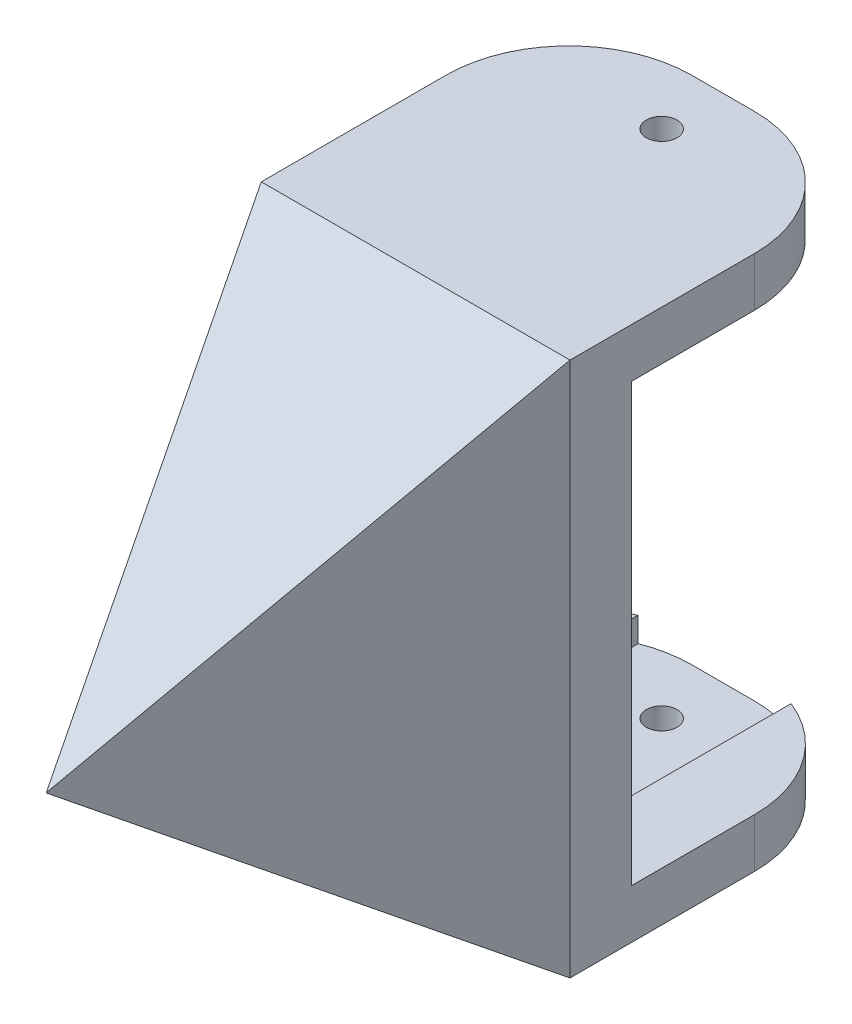
ISO-10303-21;
HEADER;
FILE_DESCRIPTION(('STEP AP214'),'2;1');
FILE_NAME('part.step','',(''),(''),'','','');
FILE_SCHEMA(('AUTOMOTIVE_DESIGN { 1 0 10303 214 1 1 1 1 }'));
ENDSEC;
DATA;
#1=APPLICATION_CONTEXT('core data for automotive mechanical design processes');
#2=APPLICATION_PROTOCOL_DEFINITION('international standard','automotive_design',2000,#1);
#3=PRODUCT_CONTEXT('',#1,'mechanical');
#4=PRODUCT('Part','Part','',(#3));
#5=PRODUCT_RELATED_PRODUCT_CATEGORY('part','',(#4));
#6=PRODUCT_DEFINITION_FORMATION('','',#4);
#7=PRODUCT_DEFINITION_CONTEXT('part definition',#1,'design');
#8=PRODUCT_DEFINITION('design','',#6,#7);
#9=PRODUCT_DEFINITION_SHAPE('','',#8);
#10=(LENGTH_UNIT() NAMED_UNIT(*) SI_UNIT(.MILLI.,.METRE.));
#11=(NAMED_UNIT(*) PLANE_ANGLE_UNIT() SI_UNIT($,.RADIAN.));
#12=(NAMED_UNIT(*) SI_UNIT($,.STERADIAN.) SOLID_ANGLE_UNIT());
#13=UNCERTAINTY_MEASURE_WITH_UNIT(LENGTH_MEASURE(1.E-05),#10,'distance_accuracy_value','');
#14=(GEOMETRIC_REPRESENTATION_CONTEXT(3) GLOBAL_UNCERTAINTY_ASSIGNED_CONTEXT((#13)) GLOBAL_UNIT_ASSIGNED_CONTEXT((#10,
#11,#12)) REPRESENTATION_CONTEXT('',''));
#15=CARTESIAN_POINT('',(0.,0.,0.));
#16=DIRECTION('',(0.,0.,1.));
#17=DIRECTION('',(1.,0.,0.));
#18=AXIS2_PLACEMENT_3D('',#15,#16,#17);
#19=CARTESIAN_POINT('',(62.7189846417763,-21.75,-25.));
#20=DIRECTION('',(0.,1.,0.));
#21=DIRECTION('',(0.,0.,1.));
#22=AXIS2_PLACEMENT_3D('',#19,#20,#21);
#23=PLANE('',#22);
#24=CARTESIAN_POINT('',(0.,-21.75,-20.));
#25=DIRECTION('',(0.,1.,0.));
#26=DIRECTION('',(0.,0.,1.));
#27=AXIS2_PLACEMENT_3D('',#24,#25,#26);
#28=CIRCLE('',#27,1.25);
#29=CARTESIAN_POINT('',(0.,-21.75,-18.75));
#30=VERTEX_POINT('',#29);
#31=EDGE_CURVE('E266',#30,#30,#28,.T.);
#32=ORIENTED_EDGE('',*,*,#31,.T.);
#33=EDGE_LOOP('',(#32));
#34=FACE_BOUND('',#33,.T.);
#35=DIRECTION('',(1.,0.,0.));
#36=VECTOR('',#35,1.);
#37=CARTESIAN_POINT('',(-12.5467811820916,-21.75,0.));
#38=LINE('',#37,#36);
#39=CARTESIAN_POINT('',(-12.5467811820916,-21.75,0.));
#40=VERTEX_POINT('',#39);
#41=CARTESIAN_POINT('',(12.5467811820916,-21.75,0.));
#42=VERTEX_POINT('',#41);
#43=EDGE_CURVE('E195',#40,#42,#38,.T.);
#44=ORIENTED_EDGE('',*,*,#43,.F.);
#45=DIRECTION('',(0.,0.,-1.));
#46=VECTOR('',#45,1.);
#47=CARTESIAN_POINT('',(-12.5467811820916,-21.75,-25.));
#48=LINE('',#47,#46);
#49=CARTESIAN_POINT('',(-12.5467811820916,-21.75,-15.));
#50=VERTEX_POINT('',#49);
#51=EDGE_CURVE('E178',#40,#50,#48,.T.);
#52=ORIENTED_EDGE('',*,*,#51,.T.);
#53=CARTESIAN_POINT('',(-2.54678118209162,-21.75,-15.));
#54=DIRECTION('',(0.,1.,0.));
#55=DIRECTION('',(0.,0.,1.));
#56=AXIS2_PLACEMENT_3D('',#53,#54,#55);
#57=CIRCLE('',#56,10.);
#58=CARTESIAN_POINT('',(-2.54678118209162,-21.75,-25.));
#59=VERTEX_POINT('',#58);
#60=EDGE_CURVE('E189',#50,#59,#57,.F.);
#61=ORIENTED_EDGE('',*,*,#60,.T.);
#62=DIRECTION('',(-1.,0.,0.));
#63=VECTOR('',#62,1.);
#64=CARTESIAN_POINT('',(62.7189846417763,-21.75,-25.));
#65=LINE('',#64,#63);
#66=CARTESIAN_POINT('',(2.54678118209161,-21.75,-25.));
#67=VERTEX_POINT('',#66);
#68=EDGE_CURVE('E295',#67,#59,#65,.T.);
#69=ORIENTED_EDGE('',*,*,#68,.F.);
#70=CARTESIAN_POINT('',(2.54678118209161,-21.75,-15.));
#71=DIRECTION('',(0.,1.,0.));
#72=DIRECTION('',(0.,0.,1.));
#73=AXIS2_PLACEMENT_3D('',#70,#71,#72);
#74=CIRCLE('',#73,10.);
#75=CARTESIAN_POINT('',(12.5467811820916,-21.75,-15.));
#76=VERTEX_POINT('',#75);
#77=EDGE_CURVE('E199',#67,#76,#74,.F.);
#78=ORIENTED_EDGE('',*,*,#77,.T.);
#79=DIRECTION('',(0.,0.,-1.));
#80=VECTOR('',#79,1.);
#81=CARTESIAN_POINT('',(12.5467811820916,-21.75,-25.));
#82=LINE('',#81,#80);
#83=EDGE_CURVE('E193',#42,#76,#82,.T.);
#84=ORIENTED_EDGE('',*,*,#83,.F.);
#85=EDGE_LOOP('',(#44,#52,#61,#69,#78,#84));
#86=FACE_BOUND('',#85,.T.);
#87=ADVANCED_FACE('F41',(#34,#86),#23,.F.);
#88=CARTESIAN_POINT('',(-12.5467811820916,-53.9370800671778,23.55));
#89=DIRECTION('',(-1.,0.,0.));
#90=DIRECTION('',(0.,0.,1.));
#91=AXIS2_PLACEMENT_3D('',#88,#89,#90);
#92=PLANE('',#91);
#93=DIRECTION('',(0.,0.,-1.));
#94=VECTOR('',#93,1.);
#95=CARTESIAN_POINT('',(-12.5467811820916,17.75,30.));
#96=LINE('',#95,#94);
#97=CARTESIAN_POINT('',(-12.5467811820916,17.75,0.));
#98=VERTEX_POINT('',#97);
#99=CARTESIAN_POINT('',(-12.5467811820916,17.75,-5.));
#100=VERTEX_POINT('',#99);
#101=EDGE_CURVE('E245',#98,#100,#96,.T.);
#102=ORIENTED_EDGE('',*,*,#101,.F.);
#103=DIRECTION('',(0.,-1.,0.));
#104=VECTOR('',#103,1.);
#105=CARTESIAN_POINT('',(-12.5467811820916,-21.75,0.));
#106=LINE('',#105,#104);
#107=CARTESIAN_POINT('',(-12.5467811820916,21.75,0.));
#108=VERTEX_POINT('',#107);
#109=EDGE_CURVE('E192',#108,#98,#106,.T.);
#110=ORIENTED_EDGE('',*,*,#109,.F.);
#111=DIRECTION('',(0.,0.,1.));
#112=VECTOR('',#111,1.);
#113=CARTESIAN_POINT('',(-12.5467811820916,21.75,0.));
#114=LINE('',#113,#112);
#115=CARTESIAN_POINT('',(-12.5467811820916,21.75,-15.));
#116=VERTEX_POINT('',#115);
#117=EDGE_CURVE('E300',#116,#108,#114,.T.);
#118=ORIENTED_EDGE('',*,*,#117,.F.);
#119=DIRECTION('',(0.,1.,0.));
#120=VECTOR('',#119,1.);
#121=CARTESIAN_POINT('',(-12.5467811820916,17.75,-15.));
#122=LINE('',#121,#120);
#123=CARTESIAN_POINT('',(-12.5467811820916,17.75,-15.));
#124=VERTEX_POINT('',#123);
#125=EDGE_CURVE('E212',#116,#124,#122,.F.);
#126=ORIENTED_EDGE('',*,*,#125,.T.);
#127=DIRECTION('',(0.,0.,-1.));
#128=VECTOR('',#127,1.);
#129=CARTESIAN_POINT('',(-12.5467811820916,17.75,-25.));
#130=LINE('',#129,#128);
#131=EDGE_CURVE('E303',#100,#124,#130,.T.);
#132=ORIENTED_EDGE('',*,*,#131,.F.);
#133=EDGE_LOOP('',(#102,#110,#118,#126,#132));
#134=FACE_BOUND('',#133,.T.);
#135=ADVANCED_FACE('F381',(#134),#92,.T.);
#136=CARTESIAN_POINT('',(62.7189846417763,-17.75,-5.));
#137=DIRECTION('',(0.,-1.,0.));
#138=DIRECTION('',(0.,0.,-1.));
#139=AXIS2_PLACEMENT_3D('',#136,#137,#138);
#140=PLANE('',#139);
#141=CARTESIAN_POINT('',(-2.54678118209162,-17.75,-15.));
#142=DIRECTION('',(0.,-1.,0.));
#143=DIRECTION('',(0.,0.,-1.));
#144=AXIS2_PLACEMENT_3D('',#141,#142,#143);
#145=CIRCLE('',#144,10.);
#146=CARTESIAN_POINT('',(-6.21914646917427,-17.75,-24.3012758908781));
#147=VERTEX_POINT('',#146);
#148=CARTESIAN_POINT('',(-10.239327171592,-17.75,-21.3894237767909));
#149=VERTEX_POINT('',#148);
#150=EDGE_CURVE('E206',#147,#149,#145,.F.);
#151=ORIENTED_EDGE('',*,*,#150,.T.);
#152=DIRECTION('',(0.,0.,1.));
#153=VECTOR('',#152,1.);
#154=CARTESIAN_POINT('',(-10.239327171592,-17.75,-5.00000000000001));
#155=LINE('',#154,#153);
#156=CARTESIAN_POINT('',(-10.239327171592,-17.75,-4.99999999999999));
#157=VERTEX_POINT('',#156);
#158=EDGE_CURVE('E180',#149,#157,#155,.T.);
#159=ORIENTED_EDGE('',*,*,#158,.T.);
#160=DIRECTION('',(-1.,0.,0.));
#161=VECTOR('',#160,1.);
#162=CARTESIAN_POINT('',(62.7189846417763,-17.75,-5.));
#163=LINE('',#162,#161);
#164=CARTESIAN_POINT('',(-6.21914646917426,-17.75,-4.99999999999999));
#165=VERTEX_POINT('',#164);
#166=EDGE_CURVE('E324',#165,#157,#163,.T.);
#167=ORIENTED_EDGE('',*,*,#166,.F.);
#168=DIRECTION('',(0.,0.,1.));
#169=VECTOR('',#168,1.);
#170=CARTESIAN_POINT('',(-6.21914646917427,-17.75,-25.));
#171=LINE('',#170,#169);
#172=EDGE_CURVE('E273',#147,#165,#171,.T.);
#173=ORIENTED_EDGE('',*,*,#172,.F.);
#174=EDGE_LOOP('',(#151,#159,#167,#173));
#175=FACE_BOUND('',#174,.T.);
#176=ADVANCED_FACE('F382',(#175),#140,.F.);
#177=DIRECTION('',(0.,0.,1.));
#178=VECTOR('',#177,1.);
#179=CARTESIAN_POINT('',(12.5467811820916,-17.75,-5.));
#180=LINE('',#179,#178);
#181=CARTESIAN_POINT('',(12.5467811820916,-17.75,-15.));
#182=VERTEX_POINT('',#181);
#183=CARTESIAN_POINT('',(12.5467811820916,-17.75,-5.));
#184=VERTEX_POINT('',#183);
#185=EDGE_CURVE('E319',#182,#184,#180,.T.);
#186=ORIENTED_EDGE('',*,*,#185,.F.);
#187=CARTESIAN_POINT('',(2.54678118209161,-17.75,-15.));
#188=DIRECTION('',(0.,-1.,0.));
#189=DIRECTION('',(0.,0.,-1.));
#190=AXIS2_PLACEMENT_3D('',#187,#188,#189);
#191=CIRCLE('',#190,10.);
#192=CARTESIAN_POINT('',(6.21914646917426,-17.75,-24.3012758908781));
#193=VERTEX_POINT('',#192);
#194=EDGE_CURVE('E339',#182,#193,#191,.F.);
#195=ORIENTED_EDGE('',*,*,#194,.T.);
#196=DIRECTION('',(0.,0.,-1.));
#197=VECTOR('',#196,1.);
#198=CARTESIAN_POINT('',(6.21914646917425,-17.75,-25.));
#199=LINE('',#198,#197);
#200=CARTESIAN_POINT('',(6.21914646917428,-17.75,-5.));
#201=VERTEX_POINT('',#200);
#202=EDGE_CURVE('E277',#201,#193,#199,.T.);
#203=ORIENTED_EDGE('',*,*,#202,.F.);
#204=EDGE_CURVE('E325',#184,#201,#163,.T.);
#205=ORIENTED_EDGE('',*,*,#204,.F.);
#206=EDGE_LOOP('',(#186,#195,#203,#205));
#207=FACE_BOUND('',#206,.T.);
#208=ADVANCED_FACE('F363',(#207),#140,.F.);
#209=CARTESIAN_POINT('',(12.5467811820916,-53.9370800671778,23.55));
#210=DIRECTION('',(1.,0.,0.));
#211=DIRECTION('',(0.,0.,-1.));
#212=AXIS2_PLACEMENT_3D('',#209,#210,#211);
#213=PLANE('',#212);
#214=DIRECTION('',(0.,-1.,0.));
#215=VECTOR('',#214,1.);
#216=CARTESIAN_POINT('',(12.5467811820916,-21.75,0.));
#217=LINE('',#216,#215);
#218=CARTESIAN_POINT('',(12.5467811820916,21.75,0.));
#219=VERTEX_POINT('',#218);
#220=EDGE_CURVE('E307',#219,#42,#217,.T.);
#221=ORIENTED_EDGE('',*,*,#220,.T.);
#222=ORIENTED_EDGE('',*,*,#83,.T.);
#223=DIRECTION('',(0.,1.,0.));
#224=VECTOR('',#223,1.);
#225=CARTESIAN_POINT('',(12.5467811820916,-17.75,-15.));
#226=LINE('',#225,#224);
#227=EDGE_CURVE('E338',#76,#182,#226,.T.);
#228=ORIENTED_EDGE('',*,*,#227,.T.);
#229=ORIENTED_EDGE('',*,*,#185,.T.);
#230=DIRECTION('',(0.,1.,0.));
#231=VECTOR('',#230,1.);
#232=CARTESIAN_POINT('',(12.5467811820916,17.75,-5.));
#233=LINE('',#232,#231);
#234=CARTESIAN_POINT('',(12.5467811820916,17.75,-5.));
#235=VERTEX_POINT('',#234);
#236=EDGE_CURVE('E313',#184,#235,#233,.T.);
#237=ORIENTED_EDGE('',*,*,#236,.T.);
#238=DIRECTION('',(0.,0.,-1.));
#239=VECTOR('',#238,1.);
#240=CARTESIAN_POINT('',(12.5467811820916,17.75,-25.));
#241=LINE('',#240,#239);
#242=CARTESIAN_POINT('',(12.5467811820916,17.75,-15.));
#243=VERTEX_POINT('',#242);
#244=EDGE_CURVE('E315',#235,#243,#241,.T.);
#245=ORIENTED_EDGE('',*,*,#244,.T.);
#246=DIRECTION('',(0.,1.,0.));
#247=VECTOR('',#246,1.);
#248=CARTESIAN_POINT('',(12.5467811820916,21.75,-15.));
#249=LINE('',#248,#247);
#250=CARTESIAN_POINT('',(12.5467811820916,21.75,-15.));
#251=VERTEX_POINT('',#250);
#252=EDGE_CURVE('E306',#243,#251,#249,.T.);
#253=ORIENTED_EDGE('',*,*,#252,.T.);
#254=DIRECTION('',(0.,0.,1.));
#255=VECTOR('',#254,1.);
#256=CARTESIAN_POINT('',(12.5467811820916,21.75,0.));
#257=LINE('',#256,#255);
#258=EDGE_CURVE('E309',#251,#219,#257,.T.);
#259=ORIENTED_EDGE('',*,*,#258,.T.);
#260=EDGE_LOOP('',(#221,#222,#228,#229,#237,#245,#253,#259));
#261=FACE_BOUND('',#260,.T.);
#262=ADVANCED_FACE('F362',(#261),#213,.T.);
#263=CARTESIAN_POINT('',(62.7189846417763,-17.75,-25.));
#264=DIRECTION('',(0.,0.,1.));
#265=DIRECTION('',(0.,-1.,0.));
#266=AXIS2_PLACEMENT_3D('',#263,#264,#265);
#267=PLANE('',#266);
#268=DIRECTION('',(-1.,0.,0.));
#269=VECTOR('',#268,1.);
#270=CARTESIAN_POINT('',(6.21914646917425,-19.75,-25.));
#271=LINE('',#270,#269);
#272=CARTESIAN_POINT('',(2.54678118209161,-19.75,-25.));
#273=VERTEX_POINT('',#272);
#274=CARTESIAN_POINT('',(-2.54678118209162,-19.75,-25.));
#275=VERTEX_POINT('',#274);
#276=EDGE_CURVE('E272',#273,#275,#271,.T.);
#277=ORIENTED_EDGE('',*,*,#276,.F.);
#278=DIRECTION('',(0.,1.,0.));
#279=VECTOR('',#278,1.);
#280=CARTESIAN_POINT('',(2.54678118209161,-21.75,-25.));
#281=LINE('',#280,#279);
#282=EDGE_CURVE('E201',#273,#67,#281,.F.);
#283=ORIENTED_EDGE('',*,*,#282,.T.);
#284=ORIENTED_EDGE('',*,*,#68,.T.);
#285=DIRECTION('',(0.,1.,0.));
#286=VECTOR('',#285,1.);
#287=CARTESIAN_POINT('',(-2.54678118209162,-17.75,-25.));
#288=LINE('',#287,#286);
#289=EDGE_CURVE('E197',#59,#275,#288,.T.);
#290=ORIENTED_EDGE('',*,*,#289,.T.);
#291=EDGE_LOOP('',(#277,#283,#284,#290));
#292=FACE_BOUND('',#291,.T.);
#293=ADVANCED_FACE('F348',(#292),#267,.F.);
#294=CARTESIAN_POINT('',(62.7189846417763,17.75,-5.));
#295=DIRECTION('',(0.,0.,1.));
#296=DIRECTION('',(0.,-1.,0.));
#297=AXIS2_PLACEMENT_3D('',#294,#295,#296);
#298=PLANE('',#297);
#299=ORIENTED_EDGE('',*,*,#166,.T.);
#300=DIRECTION('',(0.499683735875138,0.866207921980551,0.));
#301=VECTOR('',#300,1.);
#302=CARTESIAN_POINT('',(23.3426493553679,40.4647706938501,-5.00000000000001));
#303=LINE('',#302,#301);
#304=CARTESIAN_POINT('',(0.,0.,-5.));
#305=VERTEX_POINT('',#304);
#306=EDGE_CURVE('E250',#157,#305,#303,.T.);
#307=ORIENTED_EDGE('',*,*,#306,.T.);
#308=DIRECTION('',(-0.577216411505274,0.816591216147329,0.));
#309=VECTOR('',#308,1.);
#310=CARTESIAN_POINT('',(12.5301752807151,-17.7265075404477,-5.));
#311=LINE('',#310,#309);
#312=EDGE_CURVE('E252',#305,#100,#311,.T.);
#313=ORIENTED_EDGE('',*,*,#312,.T.);
#314=DIRECTION('',(-1.,0.,0.));
#315=VECTOR('',#314,1.);
#316=CARTESIAN_POINT('',(62.7189846417763,17.75,-5.));
#317=LINE('',#316,#315);
#318=EDGE_CURVE('E301',#235,#100,#317,.T.);
#319=ORIENTED_EDGE('',*,*,#318,.F.);
#320=ORIENTED_EDGE('',*,*,#236,.F.);
#321=ORIENTED_EDGE('',*,*,#204,.T.);
#322=DIRECTION('',(0.,1.,0.));
#323=VECTOR('',#322,1.);
#324=CARTESIAN_POINT('',(6.21914646917428,-19.75,-5.));
#325=LINE('',#324,#323);
#326=CARTESIAN_POINT('',(6.21914646917428,-19.75,-5.));
#327=VERTEX_POINT('',#326);
#328=EDGE_CURVE('E288',#327,#201,#325,.T.);
#329=ORIENTED_EDGE('',*,*,#328,.F.);
#330=DIRECTION('',(1.,0.,0.));
#331=VECTOR('',#330,1.);
#332=CARTESIAN_POINT('',(6.21914646917428,-19.75,-5.));
#333=LINE('',#332,#331);
#334=CARTESIAN_POINT('',(-6.21914646917426,-19.75,-4.99999999999999));
#335=VERTEX_POINT('',#334);
#336=EDGE_CURVE('E279',#335,#327,#333,.T.);
#337=ORIENTED_EDGE('',*,*,#336,.F.);
#338=DIRECTION('',(0.,1.,0.));
#339=VECTOR('',#338,1.);
#340=CARTESIAN_POINT('',(-6.21914646917426,-19.75,-4.99999999999999));
#341=LINE('',#340,#339);
#342=EDGE_CURVE('E287',#335,#165,#341,.T.);
#343=ORIENTED_EDGE('',*,*,#342,.T.);
#344=EDGE_LOOP('',(#299,#307,#313,#319,#320,#321,#329,#337,#343));
#345=FACE_BOUND('',#344,.T.);
#346=ADVANCED_FACE('F375',(#345),#298,.F.);
#347=CARTESIAN_POINT('',(62.7189846417763,17.75,-25.));
#348=DIRECTION('',(0.,1.,0.));
#349=DIRECTION('',(0.,0.,1.));
#350=AXIS2_PLACEMENT_3D('',#347,#348,#349);
#351=PLANE('',#350);
#352=CARTESIAN_POINT('',(0.,17.75,-20.));
#353=DIRECTION('',(0.,1.,0.));
#354=DIRECTION('',(0.,0.,1.));
#355=AXIS2_PLACEMENT_3D('',#352,#353,#354);
#356=CIRCLE('',#355,1.25);
#357=CARTESIAN_POINT('',(0.,17.75,-18.75));
#358=VERTEX_POINT('',#357);
#359=EDGE_CURVE('E269',#358,#358,#356,.T.);
#360=ORIENTED_EDGE('',*,*,#359,.T.);
#361=EDGE_LOOP('',(#360));
#362=FACE_BOUND('',#361,.T.);
#363=ORIENTED_EDGE('',*,*,#131,.T.);
#364=CARTESIAN_POINT('',(-2.54678118209162,17.75,-15.));
#365=DIRECTION('',(0.,1.,0.));
#366=DIRECTION('',(0.,0.,1.));
#367=AXIS2_PLACEMENT_3D('',#364,#365,#366);
#368=CIRCLE('',#367,10.);
#369=CARTESIAN_POINT('',(-2.54678118209162,17.75,-25.));
#370=VERTEX_POINT('',#369);
#371=EDGE_CURVE('E223',#124,#370,#368,.F.);
#372=ORIENTED_EDGE('',*,*,#371,.T.);
#373=DIRECTION('',(-1.,0.,0.));
#374=VECTOR('',#373,1.);
#375=CARTESIAN_POINT('',(62.7189846417763,17.75,-25.));
#376=LINE('',#375,#374);
#377=CARTESIAN_POINT('',(2.54678118209161,17.75,-25.));
#378=VERTEX_POINT('',#377);
#379=EDGE_CURVE('E305',#378,#370,#376,.T.);
#380=ORIENTED_EDGE('',*,*,#379,.F.);
#381=CARTESIAN_POINT('',(2.54678118209161,17.75,-15.));
#382=DIRECTION('',(0.,1.,0.));
#383=DIRECTION('',(0.,0.,1.));
#384=AXIS2_PLACEMENT_3D('',#381,#382,#383);
#385=CIRCLE('',#384,10.);
#386=EDGE_CURVE('E216',#378,#243,#385,.F.);
#387=ORIENTED_EDGE('',*,*,#386,.T.);
#388=ORIENTED_EDGE('',*,*,#244,.F.);
#389=ORIENTED_EDGE('',*,*,#318,.T.);
#390=EDGE_LOOP('',(#363,#372,#380,#387,#388,#389));
#391=FACE_BOUND('',#390,.T.);
#392=ADVANCED_FACE('F410',(#362,#391),#351,.F.);
#393=CARTESIAN_POINT('',(62.7189846417763,21.75,-25.));
#394=DIRECTION('',(0.,0.,1.));
#395=DIRECTION('',(0.,-1.,0.));
#396=AXIS2_PLACEMENT_3D('',#393,#394,#395);
#397=PLANE('',#396);
#398=ORIENTED_EDGE('',*,*,#379,.T.);
#399=DIRECTION('',(0.,1.,0.));
#400=VECTOR('',#399,1.);
#401=CARTESIAN_POINT('',(-2.54678118209162,21.75,-25.));
#402=LINE('',#401,#400);
#403=CARTESIAN_POINT('',(-2.54678118209162,21.75,-25.));
#404=VERTEX_POINT('',#403);
#405=EDGE_CURVE('E213',#370,#404,#402,.T.);
#406=ORIENTED_EDGE('',*,*,#405,.T.);
#407=DIRECTION('',(-1.,0.,0.));
#408=VECTOR('',#407,1.);
#409=CARTESIAN_POINT('',(62.7189846417763,21.75,-25.));
#410=LINE('',#409,#408);
#411=CARTESIAN_POINT('',(2.54678118209161,21.75,-25.));
#412=VERTEX_POINT('',#411);
#413=EDGE_CURVE('E299',#412,#404,#410,.T.);
#414=ORIENTED_EDGE('',*,*,#413,.F.);
#415=DIRECTION('',(0.,1.,0.));
#416=VECTOR('',#415,1.);
#417=CARTESIAN_POINT('',(2.54678118209161,17.75,-25.));
#418=LINE('',#417,#416);
#419=EDGE_CURVE('E214',#412,#378,#418,.F.);
#420=ORIENTED_EDGE('',*,*,#419,.T.);
#421=EDGE_LOOP('',(#398,#406,#414,#420));
#422=FACE_BOUND('',#421,.T.);
#423=ADVANCED_FACE('F401',(#422),#397,.F.);
#424=CARTESIAN_POINT('',(62.7189846417763,21.75,0.));
#425=DIRECTION('',(0.,-1.,0.));
#426=DIRECTION('',(0.,0.,-1.));
#427=AXIS2_PLACEMENT_3D('',#424,#425,#426);
#428=PLANE('',#427);
#429=CARTESIAN_POINT('',(0.,21.75,-20.));
#430=DIRECTION('',(0.,1.,0.));
#431=DIRECTION('',(0.,0.,1.));
#432=AXIS2_PLACEMENT_3D('',#429,#430,#431);
#433=CIRCLE('',#432,1.25);
#434=CARTESIAN_POINT('',(0.,21.75,-18.75));
#435=VERTEX_POINT('',#434);
#436=EDGE_CURVE('E261',#435,#435,#433,.T.);
#437=ORIENTED_EDGE('',*,*,#436,.F.);
#438=EDGE_LOOP('',(#437));
#439=FACE_BOUND('',#438,.T.);
#440=ORIENTED_EDGE('',*,*,#117,.T.);
#441=DIRECTION('',(1.,0.,0.));
#442=VECTOR('',#441,1.);
#443=CARTESIAN_POINT('',(-12.5467811820916,21.75,0.));
#444=LINE('',#443,#442);
#445=EDGE_CURVE('E257',#108,#219,#444,.T.);
#446=ORIENTED_EDGE('',*,*,#445,.T.);
#447=ORIENTED_EDGE('',*,*,#258,.F.);
#448=CARTESIAN_POINT('',(2.54678118209161,21.75,-15.));
#449=DIRECTION('',(0.,-1.,0.));
#450=DIRECTION('',(0.,0.,-1.));
#451=AXIS2_PLACEMENT_3D('',#448,#449,#450);
#452=CIRCLE('',#451,10.);
#453=EDGE_CURVE('E61',#251,#412,#452,.F.);
#454=ORIENTED_EDGE('',*,*,#453,.T.);
#455=ORIENTED_EDGE('',*,*,#413,.T.);
#456=CARTESIAN_POINT('',(-2.54678118209162,21.75,-15.));
#457=DIRECTION('',(0.,-1.,0.));
#458=DIRECTION('',(0.,0.,-1.));
#459=AXIS2_PLACEMENT_3D('',#456,#457,#458);
#460=CIRCLE('',#459,10.);
#461=EDGE_CURVE('E57',#404,#116,#460,.F.);
#462=ORIENTED_EDGE('',*,*,#461,.T.);
#463=EDGE_LOOP('',(#440,#446,#447,#454,#455,#462));
#464=FACE_BOUND('',#463,.T.);
#465=ADVANCED_FACE('F402',(#439,#464),#428,.F.);
#466=CARTESIAN_POINT('',(6.21914646917425,-19.75,-25.));
#467=DIRECTION('',(1.,0.,0.));
#468=DIRECTION('',(0.,0.,-1.));
#469=AXIS2_PLACEMENT_3D('',#466,#467,#468);
#470=PLANE('',#469);
#471=ORIENTED_EDGE('',*,*,#202,.T.);
#472=DIRECTION('',(0.,-1.,0.));
#473=VECTOR('',#472,1.);
#474=CARTESIAN_POINT('',(6.21914646917426,-17.75,-24.3012758908781));
#475=LINE('',#474,#473);
#476=CARTESIAN_POINT('',(6.21914646917426,-19.75,-24.3012758908781));
#477=VERTEX_POINT('',#476);
#478=EDGE_CURVE('E341',#193,#477,#475,.T.);
#479=ORIENTED_EDGE('',*,*,#478,.T.);
#480=DIRECTION('',(0.,0.,-1.));
#481=VECTOR('',#480,1.);
#482=CARTESIAN_POINT('',(6.21914646917425,-19.75,-25.));
#483=LINE('',#482,#481);
#484=EDGE_CURVE('E284',#327,#477,#483,.T.);
#485=ORIENTED_EDGE('',*,*,#484,.F.);
#486=ORIENTED_EDGE('',*,*,#328,.T.);
#487=EDGE_LOOP('',(#471,#479,#485,#486));
#488=FACE_BOUND('',#487,.T.);
#489=ADVANCED_FACE('F369',(#488),#470,.F.);
#490=CARTESIAN_POINT('',(-6.21914646917427,-19.75,-25.));
#491=DIRECTION('',(-1.,0.,0.));
#492=DIRECTION('',(0.,0.,1.));
#493=AXIS2_PLACEMENT_3D('',#490,#491,#492);
#494=PLANE('',#493);
#495=DIRECTION('',(0.,0.,1.));
#496=VECTOR('',#495,1.);
#497=CARTESIAN_POINT('',(-6.21914646917427,-19.75,-25.));
#498=LINE('',#497,#496);
#499=CARTESIAN_POINT('',(-6.21914646917427,-19.75,-24.3012758908781));
#500=VERTEX_POINT('',#499);
#501=EDGE_CURVE('E280',#500,#335,#498,.T.);
#502=ORIENTED_EDGE('',*,*,#501,.F.);
#503=DIRECTION('',(0.,-1.,0.));
#504=VECTOR('',#503,1.);
#505=CARTESIAN_POINT('',(-6.21914646917427,-19.75,-24.3012758908781));
#506=LINE('',#505,#504);
#507=EDGE_CURVE('E202',#500,#147,#506,.F.);
#508=ORIENTED_EDGE('',*,*,#507,.T.);
#509=ORIENTED_EDGE('',*,*,#172,.T.);
#510=ORIENTED_EDGE('',*,*,#342,.F.);
#511=EDGE_LOOP('',(#502,#508,#509,#510));
#512=FACE_BOUND('',#511,.T.);
#513=ADVANCED_FACE('F379',(#512),#494,.F.);
#514=CARTESIAN_POINT('',(0.,-19.75,0.));
#515=DIRECTION('',(0.,1.,0.));
#516=DIRECTION('',(0.,0.,1.));
#517=AXIS2_PLACEMENT_3D('',#514,#515,#516);
#518=PLANE('',#517);
#519=CARTESIAN_POINT('',(0.,-19.75,-20.));
#520=DIRECTION('',(0.,1.,0.));
#521=DIRECTION('',(0.,0.,1.));
#522=AXIS2_PLACEMENT_3D('',#519,#520,#521);
#523=CIRCLE('',#522,1.25);
#524=CARTESIAN_POINT('',(0.,-19.75,-18.75));
#525=VERTEX_POINT('',#524);
#526=EDGE_CURVE('E267',#525,#525,#523,.T.);
#527=ORIENTED_EDGE('',*,*,#526,.F.);
#528=EDGE_LOOP('',(#527));
#529=FACE_BOUND('',#528,.T.);
#530=ORIENTED_EDGE('',*,*,#484,.T.);
#531=CARTESIAN_POINT('',(2.54678118209161,-19.75,-15.));
#532=DIRECTION('',(0.,1.,0.));
#533=DIRECTION('',(0.,0.,1.));
#534=AXIS2_PLACEMENT_3D('',#531,#532,#533);
#535=CIRCLE('',#534,10.);
#536=EDGE_CURVE('E344',#477,#273,#535,.T.);
#537=ORIENTED_EDGE('',*,*,#536,.T.);
#538=ORIENTED_EDGE('',*,*,#276,.T.);
#539=CARTESIAN_POINT('',(-2.54678118209162,-19.75,-15.));
#540=DIRECTION('',(0.,1.,0.));
#541=DIRECTION('',(0.,0.,1.));
#542=AXIS2_PLACEMENT_3D('',#539,#540,#541);
#543=CIRCLE('',#542,10.);
#544=EDGE_CURVE('E343',#275,#500,#543,.T.);
#545=ORIENTED_EDGE('',*,*,#544,.T.);
#546=ORIENTED_EDGE('',*,*,#501,.T.);
#547=ORIENTED_EDGE('',*,*,#336,.T.);
#548=EDGE_LOOP('',(#530,#537,#538,#545,#546,#547));
#549=FACE_BOUND('',#548,.T.);
#550=ADVANCED_FACE('F351',(#529,#549),#518,.T.);
#551=CARTESIAN_POINT('',(0.,-21.75,-20.));
#552=DIRECTION('',(0.,1.,0.));
#553=DIRECTION('',(0.,0.,1.));
#554=AXIS2_PLACEMENT_3D('',#551,#552,#553);
#555=CYLINDRICAL_SURFACE('',#554,1.25);
#556=ORIENTED_EDGE('',*,*,#526,.T.);
#557=EDGE_LOOP('',(#556));
#558=FACE_BOUND('',#557,.T.);
#559=ORIENTED_EDGE('',*,*,#31,.F.);
#560=EDGE_LOOP('',(#559));
#561=FACE_BOUND('',#560,.T.);
#562=ADVANCED_FACE('F459',(#558,#561),#555,.F.);
#563=ORIENTED_EDGE('',*,*,#436,.T.);
#564=EDGE_LOOP('',(#563));
#565=FACE_BOUND('',#564,.T.);
#566=ORIENTED_EDGE('',*,*,#359,.F.);
#567=EDGE_LOOP('',(#566));
#568=FACE_BOUND('',#567,.T.);
#569=ADVANCED_FACE('F423',(#565,#568),#555,.F.);
#570=CARTESIAN_POINT('',(2.54678118209161,-53.9370800671777,-15.0000000000001));
#571=DIRECTION('',(0.,-1.,0.));
#572=DIRECTION('',(0.,0.,-1.));
#573=AXIS2_PLACEMENT_3D('',#570,#571,#572);
#574=CYLINDRICAL_SURFACE('',#573,10.);
#575=ORIENTED_EDGE('',*,*,#77,.F.);
#576=ORIENTED_EDGE('',*,*,#282,.F.);
#577=ORIENTED_EDGE('',*,*,#536,.F.);
#578=ORIENTED_EDGE('',*,*,#478,.F.);
#579=ORIENTED_EDGE('',*,*,#194,.F.);
#580=ORIENTED_EDGE('',*,*,#227,.F.);
#581=EDGE_LOOP('',(#575,#576,#577,#578,#579,#580));
#582=FACE_BOUND('',#581,.T.);
#583=ADVANCED_FACE('F359',(#582),#574,.T.);
#584=CARTESIAN_POINT('',(-2.54678118209162,-17.75,-15.));
#585=DIRECTION('',(0.,-1.,0.));
#586=DIRECTION('',(0.,0.,-1.));
#587=AXIS2_PLACEMENT_3D('',#584,#585,#586);
#588=CYLINDRICAL_SURFACE('',#587,10.);
#589=CARTESIAN_POINT('',(-2.54678118209162,-4.41487660512929,-14.9999999999999));
#590=DIRECTION('',(0.866207921980551,-0.499683735875138,0.));
#591=DIRECTION('',(-0.499683735875138,-0.866207921980551,0.));
#592=AXIS2_PLACEMENT_3D('',#589,#590,#591);
#593=ELLIPSE('',#592,20.0126585718988,10.);
#594=EDGE_CURVE('E171',#149,#50,#593,.F.);
#595=ORIENTED_EDGE('',*,*,#594,.F.);
#596=ORIENTED_EDGE('',*,*,#150,.F.);
#597=ORIENTED_EDGE('',*,*,#507,.F.);
#598=ORIENTED_EDGE('',*,*,#544,.F.);
#599=ORIENTED_EDGE('',*,*,#289,.F.);
#600=ORIENTED_EDGE('',*,*,#60,.F.);
#601=EDGE_LOOP('',(#595,#596,#597,#598,#599,#600));
#602=FACE_BOUND('',#601,.T.);
#603=ADVANCED_FACE('F200',(#602),#588,.T.);
#604=CARTESIAN_POINT('',(-2.54678118209162,21.75,-15.));
#605=DIRECTION('',(0.,-1.,0.));
#606=DIRECTION('',(0.,0.,-1.));
#607=AXIS2_PLACEMENT_3D('',#604,#605,#606);
#608=CYLINDRICAL_SURFACE('',#607,10.);
#609=ORIENTED_EDGE('',*,*,#371,.F.);
#610=ORIENTED_EDGE('',*,*,#125,.F.);
#611=ORIENTED_EDGE('',*,*,#461,.F.);
#612=ORIENTED_EDGE('',*,*,#405,.F.);
#613=EDGE_LOOP('',(#609,#610,#611,#612));
#614=FACE_BOUND('',#613,.T.);
#615=ADVANCED_FACE('F424',(#614),#608,.T.);
#616=CARTESIAN_POINT('',(2.54678118209161,-53.9370800671778,-15.));
#617=DIRECTION('',(0.,-1.,0.));
#618=DIRECTION('',(0.,0.,-1.));
#619=AXIS2_PLACEMENT_3D('',#616,#617,#618);
#620=CYLINDRICAL_SURFACE('',#619,10.);
#621=ORIENTED_EDGE('',*,*,#386,.F.);
#622=ORIENTED_EDGE('',*,*,#419,.F.);
#623=ORIENTED_EDGE('',*,*,#453,.F.);
#624=ORIENTED_EDGE('',*,*,#252,.F.);
#625=EDGE_LOOP('',(#621,#622,#623,#624));
#626=FACE_BOUND('',#625,.T.);
#627=ADVANCED_FACE('F43',(#626),#620,.T.);
#628=CARTESIAN_POINT('',(12.5467811820916,-21.75,0.));
#629=DIRECTION('',(0.922286989349462,0.,0.386505768749582));
#630=DIRECTION('',(0.386505768749582,0.,-0.922286989349462));
#631=AXIS2_PLACEMENT_3D('',#628,#629,#630);
#632=PLANE('',#631);
#633=DIRECTION('',(0.321095530084189,0.556623063555085,-0.766203906071031));
#634=VECTOR('',#633,1.);
#635=CARTESIAN_POINT('',(4.77206195434683,8.27242828265701,18.5521742994731));
#636=LINE('',#635,#634);
#637=CARTESIAN_POINT('',(-0.0155796718918816,-0.0270075534697359,29.9765305149912));
#638=VERTEX_POINT('',#637);
#639=CARTESIAN_POINT('',(0.,0.,29.9393540228247));
#640=VERTEX_POINT('',#639);
#641=EDGE_CURVE('E185',#638,#640,#636,.T.);
#642=ORIENTED_EDGE('',*,*,#641,.F.);
#643=DIRECTION('',(-0.321342267556626,0.555669092141227,0.766792675447875));
#644=VECTOR('',#643,1.);
#645=CARTESIAN_POINT('',(12.5467811820916,-21.75,0.));
#646=LINE('',#645,#644);
#647=EDGE_CURVE('E230',#42,#638,#646,.T.);
#648=ORIENTED_EDGE('',*,*,#647,.F.);
#649=ORIENTED_EDGE('',*,*,#220,.F.);
#650=DIRECTION('',(0.321342267556626,0.555669092141227,-0.766792675447875));
#651=VECTOR('',#650,1.);
#652=CARTESIAN_POINT('',(4.77942265762059,8.31858591169409,18.5346100574599));
#653=LINE('',#652,#651);
#654=CARTESIAN_POINT('',(-0.0171595178991377,0.0242756638766002,29.9803003718354));
#655=VERTEX_POINT('',#654);
#656=EDGE_CURVE('E259',#655,#219,#653,.T.);
#657=ORIENTED_EDGE('',*,*,#656,.F.);
#658=DIRECTION('',(-0.339120880045265,0.479756164823781,0.809216319058694));
#659=VECTOR('',#658,1.);
#660=CARTESIAN_POINT('',(13.1975625133803,-18.6706639107457,-1.55290607097766));
#661=LINE('',#660,#659);
#662=EDGE_CURVE('E236',#640,#655,#661,.T.);
#663=ORIENTED_EDGE('',*,*,#662,.F.);
#664=EDGE_LOOP('',(#642,#648,#649,#657,#663));
#665=FACE_BOUND('',#664,.T.);
#666=ADVANCED_FACE('F233',(#665),#632,.T.);
#667=CARTESIAN_POINT('',(-0.0254151043009368,-21.75,30.));
#668=DIRECTION('',(-0.922843409478252,0.,0.385175338751789));
#669=DIRECTION('',(0.385175338751789,0.,0.922843409478252));
#670=AXIS2_PLACEMENT_3D('',#667,#668,#669);
#671=PLANE('',#670);
#672=DIRECTION('',(-0.338221167898573,0.478483337126221,-0.810345690232187));
#673=VECTOR('',#672,1.);
#674=CARTESIAN_POINT('',(3.50027553987889,-4.95185896136693,38.4472188312585));
#675=LINE('',#674,#673);
#676=CARTESIAN_POINT('',(-0.106138970431229,0.150155382309755,29.8065933086802));
#677=VERTEX_POINT('',#676);
#678=EDGE_CURVE('E249',#677,#98,#675,.T.);
#679=ORIENTED_EDGE('',*,*,#678,.F.);
#680=DIRECTION('',(0.320176488013293,-0.555900754451638,0.767112356648994));
#681=VECTOR('',#680,1.);
#682=CARTESIAN_POINT('',(3.84756789877427,-6.71439811788583,39.2792982307532));
#683=LINE('',#682,#681);
#684=EDGE_CURVE('E221',#108,#677,#683,.T.);
#685=ORIENTED_EDGE('',*,*,#684,.F.);
#686=ORIENTED_EDGE('',*,*,#109,.T.);
#687=EDGE_LOOP('',(#679,#685,#686));
#688=FACE_BOUND('',#687,.T.);
#689=ADVANCED_FACE('F447',(#688),#671,.T.);
#690=CARTESIAN_POINT('',(-12.5467811820916,21.75,0.));
#691=DIRECTION('',(0.,-0.80973869074154,-0.586790637890703));
#692=DIRECTION('',(0.,0.586790637890702,-0.809738690741539));
#693=AXIS2_PLACEMENT_3D('',#690,#691,#692);
#694=PLANE('',#693);
#695=ORIENTED_EDGE('',*,*,#684,.T.);
#696=DIRECTION('',(0.383129479592113,-0.542015371437785,0.747951294532362));
#697=VECTOR('',#696,1.);
#698=CARTESIAN_POINT('',(-14.9591894705444,21.1628472074699,0.810238444153764));
#699=LINE('',#698,#697);
#700=EDGE_CURVE('E11',#677,#655,#699,.T.);
#701=ORIENTED_EDGE('',*,*,#700,.T.);
#702=ORIENTED_EDGE('',*,*,#656,.T.);
#703=ORIENTED_EDGE('',*,*,#445,.F.);
#704=EDGE_LOOP('',(#695,#701,#702,#703));
#705=FACE_BOUND('',#704,.T.);
#706=ADVANCED_FACE('F441',(#705),#694,.F.);
#707=CARTESIAN_POINT('',(-12.5467811820916,-0.01,30.));
#708=DIRECTION('',(0.,0.80973869074154,-0.586790637890703));
#709=DIRECTION('',(0.,0.586790637890702,0.809738690741539));
#710=AXIS2_PLACEMENT_3D('',#707,#708,#709);
#711=PLANE('',#710);
#712=ORIENTED_EDGE('',*,*,#647,.T.);
#713=DIRECTION('',(-0.3206272482416,-0.555811291202599,-0.766988902303494));
#714=VECTOR('',#713,1.);
#715=CARTESIAN_POINT('',(-1.29500770394973,-2.24491183452768,26.9159450305506));
#716=LINE('',#715,#714);
#717=EDGE_CURVE('E47',#638,#40,#716,.T.);
#718=ORIENTED_EDGE('',*,*,#717,.T.);
#719=ORIENTED_EDGE('',*,*,#43,.T.);
#720=EDGE_LOOP('',(#712,#718,#719));
#721=FACE_BOUND('',#720,.T.);
#722=ADVANCED_FACE('F229',(#721),#711,.F.);
#723=CARTESIAN_POINT('',(-12.5467811820916,17.75,30.));
#724=DIRECTION('',(0.816591216147329,0.577216411505274,0.));
#725=DIRECTION('',(-0.577216411505274,0.816591216147329,0.));
#726=AXIS2_PLACEMENT_3D('',#723,#724,#725);
#727=PLANE('',#726);
#728=DIRECTION('',(0.,0.,-1.));
#729=VECTOR('',#728,1.);
#730=CARTESIAN_POINT('',(0.,0.,30.));
#731=LINE('',#730,#729);
#732=EDGE_CURVE('E238',#640,#305,#731,.T.);
#733=ORIENTED_EDGE('',*,*,#732,.F.);
#734=ORIENTED_EDGE('',*,*,#662,.T.);
#735=ORIENTED_EDGE('',*,*,#700,.F.);
#736=ORIENTED_EDGE('',*,*,#678,.T.);
#737=ORIENTED_EDGE('',*,*,#101,.T.);
#738=ORIENTED_EDGE('',*,*,#312,.F.);
#739=EDGE_LOOP('',(#733,#734,#735,#736,#737,#738));
#740=FACE_BOUND('',#739,.T.);
#741=ADVANCED_FACE('F450',(#740),#727,.F.);
#742=CARTESIAN_POINT('',(0.,0.,30.));
#743=DIRECTION('',(0.866207921980551,-0.499683735875138,0.));
#744=DIRECTION('',(0.499683735875138,0.866207921980551,0.));
#745=AXIS2_PLACEMENT_3D('',#742,#743,#744);
#746=PLANE('',#745);
#747=ORIENTED_EDGE('',*,*,#158,.F.);
#748=ORIENTED_EDGE('',*,*,#594,.T.);
#749=ORIENTED_EDGE('',*,*,#51,.F.);
#750=ORIENTED_EDGE('',*,*,#717,.F.);
#751=ORIENTED_EDGE('',*,*,#641,.T.);
#752=ORIENTED_EDGE('',*,*,#732,.T.);
#753=ORIENTED_EDGE('',*,*,#306,.F.);
#754=EDGE_LOOP('',(#747,#748,#749,#750,#751,#752,#753));
#755=FACE_BOUND('',#754,.T.);
#756=ADVANCED_FACE('F174',(#755),#746,.F.);
#757=CLOSED_SHELL('',(#87,#135,#176,#208,#262,#293,#346,#392,#423,#465,#489,#513,#550,#562,#569,
#583,#603,#615,#627,#666,#689,#706,#722,#741,#756));
#758=MANIFOLD_SOLID_BREP('B2',#757);
#759=ADVANCED_BREP_SHAPE_REPRESENTATION('',(#18,#758),#14);
#760=SHAPE_DEFINITION_REPRESENTATION(#9,#759);
ENDSEC;
END-ISO-10303-21;
